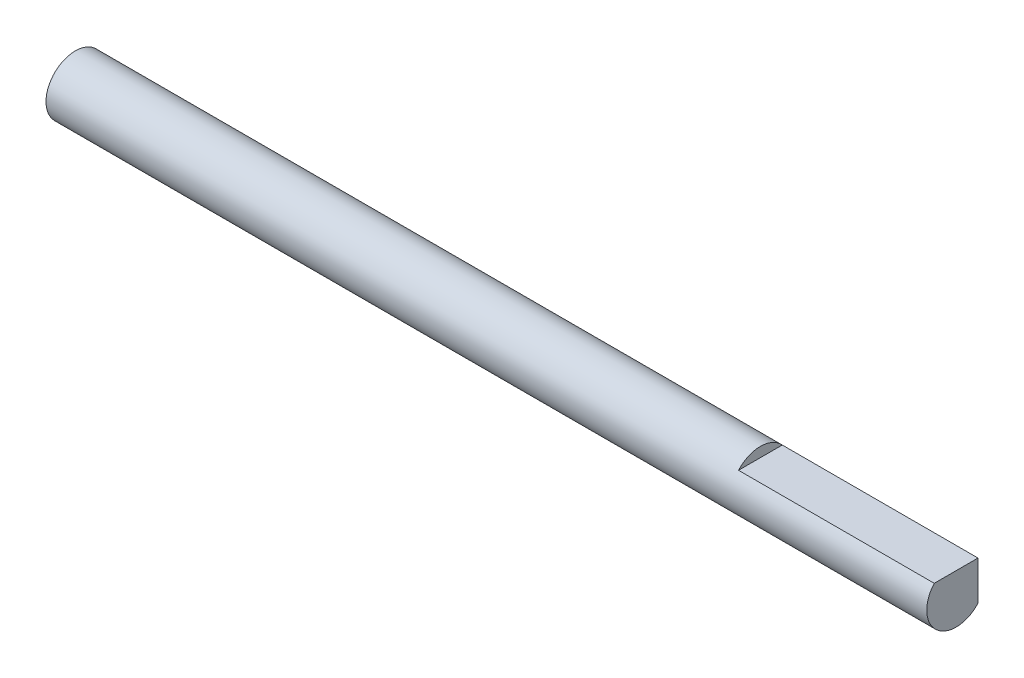
ISO-10303-21;
HEADER;
FILE_DESCRIPTION(('STEP AP214'),'2;1');
FILE_NAME('part.step','',(''),(''),'','','');
FILE_SCHEMA(('AUTOMOTIVE_DESIGN { 1 0 10303 214 1 1 1 1 }'));
ENDSEC;
DATA;
#1=APPLICATION_CONTEXT('core data for automotive mechanical design processes');
#2=APPLICATION_PROTOCOL_DEFINITION('international standard','automotive_design',2000,#1);
#3=PRODUCT_CONTEXT('',#1,'mechanical');
#4=PRODUCT('Part','Part','',(#3));
#5=PRODUCT_RELATED_PRODUCT_CATEGORY('part','',(#4));
#6=PRODUCT_DEFINITION_FORMATION('','',#4);
#7=PRODUCT_DEFINITION_CONTEXT('part definition',#1,'design');
#8=PRODUCT_DEFINITION('design','',#6,#7);
#9=PRODUCT_DEFINITION_SHAPE('','',#8);
#10=(LENGTH_UNIT() NAMED_UNIT(*) SI_UNIT(.MILLI.,.METRE.));
#11=(NAMED_UNIT(*) PLANE_ANGLE_UNIT() SI_UNIT($,.RADIAN.));
#12=(NAMED_UNIT(*) SI_UNIT($,.STERADIAN.) SOLID_ANGLE_UNIT());
#13=UNCERTAINTY_MEASURE_WITH_UNIT(LENGTH_MEASURE(1.E-05),#10,'distance_accuracy_value','');
#14=(GEOMETRIC_REPRESENTATION_CONTEXT(3) GLOBAL_UNCERTAINTY_ASSIGNED_CONTEXT((#13)) GLOBAL_UNIT_ASSIGNED_CONTEXT((#10,
#11,#12)) REPRESENTATION_CONTEXT('',''));
#15=CARTESIAN_POINT('',(0.,0.,0.));
#16=DIRECTION('',(0.,0.,1.));
#17=DIRECTION('',(1.,0.,0.));
#18=AXIS2_PLACEMENT_3D('',#15,#16,#17);
#19=CARTESIAN_POINT('',(22.5,0.,0.));
#20=DIRECTION('',(-1.,0.,0.));
#21=DIRECTION('',(0.,0.,1.));
#22=AXIS2_PLACEMENT_3D('',#19,#20,#21);
#23=CYLINDRICAL_SURFACE('',#22,1.5);
#24=CARTESIAN_POINT('',(12.5,0.,0.));
#25=DIRECTION('',(1.,0.,0.));
#26=DIRECTION('',(0.,0.,1.));
#27=AXIS2_PLACEMENT_3D('',#24,#25,#26);
#28=CIRCLE('',#27,1.5);
#29=CARTESIAN_POINT('',(12.5,1.,-1.1180339887499));
#30=VERTEX_POINT('',#29);
#31=CARTESIAN_POINT('',(12.5,1.,1.1180339887499));
#32=VERTEX_POINT('',#31);
#33=EDGE_CURVE('E84',#30,#32,#28,.T.);
#34=ORIENTED_EDGE('',*,*,#33,.F.);
#35=CARTESIAN_POINT('',(12.5,0.,0.));
#36=DIRECTION('',(-1.,0.,0.));
#37=DIRECTION('',(0.,0.,1.));
#38=AXIS2_PLACEMENT_3D('',#35,#36,#37);
#39=CIRCLE('',#38,1.50000000000002);
#40=CARTESIAN_POINT('',(12.5,-1.,-1.1180339887499));
#41=VERTEX_POINT('',#40);
#42=EDGE_CURVE('E56',#41,#30,#39,.F.);
#43=ORIENTED_EDGE('',*,*,#42,.F.);
#44=DIRECTION('',(1.,0.,0.));
#45=VECTOR('',#44,1.);
#46=CARTESIAN_POINT('',(10.4638521581795,-1.,-1.1180339887499));
#47=LINE('',#46,#45);
#48=CARTESIAN_POINT('',(22.5,-1.,-1.1180339887499));
#49=VERTEX_POINT('',#48);
#50=EDGE_CURVE('E71',#41,#49,#47,.T.);
#51=ORIENTED_EDGE('',*,*,#50,.T.);
#52=CARTESIAN_POINT('',(22.5,0.,0.));
#53=DIRECTION('',(1.,0.,0.));
#54=DIRECTION('',(0.,0.,-1.));
#55=AXIS2_PLACEMENT_3D('',#52,#53,#54);
#56=CIRCLE('',#55,1.5);
#57=CARTESIAN_POINT('',(22.5,1.,1.1180339887499));
#58=VERTEX_POINT('',#57);
#59=EDGE_CURVE('E11',#58,#49,#56,.T.);
#60=ORIENTED_EDGE('',*,*,#59,.F.);
#61=DIRECTION('',(1.,0.,0.));
#62=VECTOR('',#61,1.);
#63=CARTESIAN_POINT('',(12.5,1.,1.1180339887499));
#64=LINE('',#63,#62);
#65=EDGE_CURVE('E49',#32,#58,#64,.T.);
#66=ORIENTED_EDGE('',*,*,#65,.F.);
#67=EDGE_LOOP('',(#34,#43,#51,#60,#66));
#68=FACE_BOUND('',#67,.T.);
#69=CARTESIAN_POINT('',(-22.5,0.,0.));
#70=DIRECTION('',(1.,0.,0.));
#71=DIRECTION('',(0.,0.,-1.));
#72=AXIS2_PLACEMENT_3D('',#69,#70,#71);
#73=CIRCLE('',#72,1.5);
#74=CARTESIAN_POINT('',(-22.5,0.,-1.5));
#75=VERTEX_POINT('',#74);
#76=EDGE_CURVE('E38',#75,#75,#73,.T.);
#77=ORIENTED_EDGE('',*,*,#76,.T.);
#78=EDGE_LOOP('',(#77));
#79=FACE_BOUND('',#78,.T.);
#80=ADVANCED_FACE('F35',(#68,#79),#23,.T.);
#81=CARTESIAN_POINT('',(22.5,0.,0.));
#82=DIRECTION('',(1.,0.,0.));
#83=DIRECTION('',(0.,0.,-1.));
#84=AXIS2_PLACEMENT_3D('',#81,#82,#83);
#85=PLANE('',#84);
#86=DIRECTION('',(0.,-1.,0.));
#87=VECTOR('',#86,1.);
#88=CARTESIAN_POINT('',(22.5,1.,-1.1180339887499));
#89=LINE('',#88,#87);
#90=CARTESIAN_POINT('',(22.5,1.,-1.1180339887499));
#91=VERTEX_POINT('',#90);
#92=EDGE_CURVE('E76',#91,#49,#89,.T.);
#93=ORIENTED_EDGE('',*,*,#92,.F.);
#94=DIRECTION('',(0.,0.,-1.));
#95=VECTOR('',#94,1.);
#96=CARTESIAN_POINT('',(22.5,1.,-1.1180339887499));
#97=LINE('',#96,#95);
#98=EDGE_CURVE('E85',#58,#91,#97,.T.);
#99=ORIENTED_EDGE('',*,*,#98,.F.);
#100=ORIENTED_EDGE('',*,*,#59,.T.);
#101=EDGE_LOOP('',(#93,#99,#100));
#102=FACE_BOUND('',#101,.T.);
#103=ADVANCED_FACE('F102',(#102),#85,.T.);
#104=CARTESIAN_POINT('',(-22.5,0.,0.));
#105=DIRECTION('',(1.,0.,0.));
#106=DIRECTION('',(0.,0.,-1.));
#107=AXIS2_PLACEMENT_3D('',#104,#105,#106);
#108=PLANE('',#107);
#109=ORIENTED_EDGE('',*,*,#76,.F.);
#110=EDGE_LOOP('',(#109));
#111=FACE_BOUND('',#110,.T.);
#112=ADVANCED_FACE('F99',(#111),#108,.F.);
#113=CARTESIAN_POINT('',(12.5,1.,-1.1180339887499));
#114=DIRECTION('',(0.,-1.,0.));
#115=DIRECTION('',(0.,0.,-1.));
#116=AXIS2_PLACEMENT_3D('',#113,#114,#115);
#117=PLANE('',#116);
#118=ORIENTED_EDGE('',*,*,#98,.T.);
#119=DIRECTION('',(1.,0.,0.));
#120=VECTOR('',#119,1.);
#121=CARTESIAN_POINT('',(12.5,1.,-1.1180339887499));
#122=LINE('',#121,#120);
#123=EDGE_CURVE('E94',#30,#91,#122,.T.);
#124=ORIENTED_EDGE('',*,*,#123,.F.);
#125=DIRECTION('',(0.,0.,-1.));
#126=VECTOR('',#125,1.);
#127=CARTESIAN_POINT('',(12.5,1.,-1.1180339887499));
#128=LINE('',#127,#126);
#129=EDGE_CURVE('E91',#32,#30,#128,.T.);
#130=ORIENTED_EDGE('',*,*,#129,.F.);
#131=ORIENTED_EDGE('',*,*,#65,.T.);
#132=EDGE_LOOP('',(#118,#124,#130,#131));
#133=FACE_BOUND('',#132,.T.);
#134=ADVANCED_FACE('F101',(#133),#117,.F.);
#135=CARTESIAN_POINT('',(12.5,0.,0.));
#136=DIRECTION('',(-1.,0.,0.));
#137=DIRECTION('',(0.,0.,1.));
#138=AXIS2_PLACEMENT_3D('',#135,#136,#137);
#139=PLANE('',#138);
#140=ORIENTED_EDGE('',*,*,#33,.T.);
#141=ORIENTED_EDGE('',*,*,#129,.T.);
#142=EDGE_LOOP('',(#140,#141));
#143=FACE_BOUND('',#142,.T.);
#144=ADVANCED_FACE('F107',(#143),#139,.F.);
#145=CARTESIAN_POINT('',(12.5,0.,0.));
#146=DIRECTION('',(-1.,0.,0.));
#147=DIRECTION('',(0.,0.,1.));
#148=AXIS2_PLACEMENT_3D('',#145,#146,#147);
#149=PLANE('',#148);
#150=ORIENTED_EDGE('',*,*,#42,.T.);
#151=DIRECTION('',(0.,-1.,0.));
#152=VECTOR('',#151,1.);
#153=CARTESIAN_POINT('',(12.5,1.,-1.1180339887499));
#154=LINE('',#153,#152);
#155=EDGE_CURVE('E73',#30,#41,#154,.T.);
#156=ORIENTED_EDGE('',*,*,#155,.T.);
#157=EDGE_LOOP('',(#150,#156));
#158=FACE_BOUND('',#157,.T.);
#159=ADVANCED_FACE('F80',(#158),#149,.F.);
#160=CARTESIAN_POINT('',(10.4638521581795,1.,-1.1180339887499));
#161=DIRECTION('',(0.,0.,1.));
#162=DIRECTION('',(1.,0.,0.));
#163=AXIS2_PLACEMENT_3D('',#160,#161,#162);
#164=PLANE('',#163);
#165=ORIENTED_EDGE('',*,*,#123,.T.);
#166=ORIENTED_EDGE('',*,*,#92,.T.);
#167=ORIENTED_EDGE('',*,*,#50,.F.);
#168=ORIENTED_EDGE('',*,*,#155,.F.);
#169=EDGE_LOOP('',(#165,#166,#167,#168));
#170=FACE_BOUND('',#169,.T.);
#171=ADVANCED_FACE('F72',(#170),#164,.F.);
#172=CLOSED_SHELL('',(#80,#103,#112,#134,#144,#159,#171));
#173=MANIFOLD_SOLID_BREP('B2',#172);
#174=ADVANCED_BREP_SHAPE_REPRESENTATION('',(#18,#173),#14);
#175=SHAPE_DEFINITION_REPRESENTATION(#9,#174);
ENDSEC;
END-ISO-10303-21;
